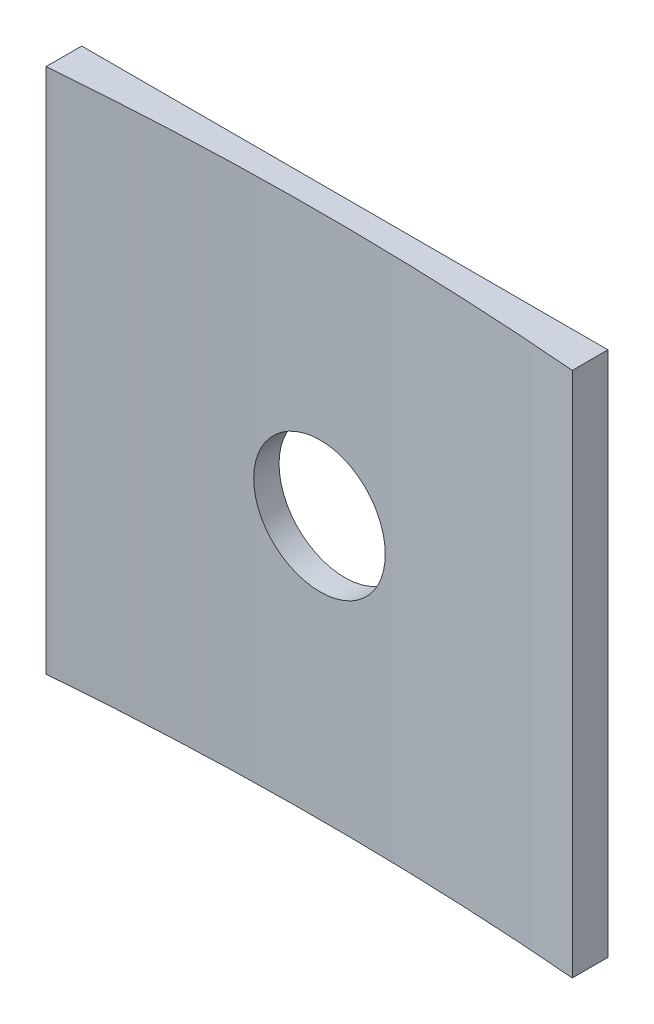
ISO-10303-21;
HEADER;
FILE_DESCRIPTION(('STEP AP214'),'2;1');
FILE_NAME('part.step','',(''),(''),'','','');
FILE_SCHEMA(('AUTOMOTIVE_DESIGN { 1 0 10303 214 1 1 1 1 }'));
ENDSEC;
DATA;
#1=APPLICATION_CONTEXT('core data for automotive mechanical design processes');
#2=APPLICATION_PROTOCOL_DEFINITION('international standard','automotive_design',2000,#1);
#3=PRODUCT_CONTEXT('',#1,'mechanical');
#4=PRODUCT('Part','Part','',(#3));
#5=PRODUCT_RELATED_PRODUCT_CATEGORY('part','',(#4));
#6=PRODUCT_DEFINITION_FORMATION('','',#4);
#7=PRODUCT_DEFINITION_CONTEXT('part definition',#1,'design');
#8=PRODUCT_DEFINITION('design','',#6,#7);
#9=PRODUCT_DEFINITION_SHAPE('','',#8);
#10=(LENGTH_UNIT() NAMED_UNIT(*) SI_UNIT(.MILLI.,.METRE.));
#11=(NAMED_UNIT(*) PLANE_ANGLE_UNIT() SI_UNIT($,.RADIAN.));
#12=(NAMED_UNIT(*) SI_UNIT($,.STERADIAN.) SOLID_ANGLE_UNIT());
#13=UNCERTAINTY_MEASURE_WITH_UNIT(LENGTH_MEASURE(1.E-05),#10,'distance_accuracy_value','');
#14=(GEOMETRIC_REPRESENTATION_CONTEXT(3) GLOBAL_UNCERTAINTY_ASSIGNED_CONTEXT((#13)) GLOBAL_UNIT_ASSIGNED_CONTEXT((#10,
#11,#12)) REPRESENTATION_CONTEXT('',''));
#15=CARTESIAN_POINT('',(0.,0.,0.));
#16=DIRECTION('',(0.,0.,1.));
#17=DIRECTION('',(1.,0.,0.));
#18=AXIS2_PLACEMENT_3D('',#15,#16,#17);
#19=CARTESIAN_POINT('',(0.,-25.4,0.));
#20=DIRECTION('',(0.,1.,0.));
#21=DIRECTION('',(0.,0.,1.));
#22=AXIS2_PLACEMENT_3D('',#19,#20,#21);
#23=CYLINDRICAL_SURFACE('',#22,152.4);
#24=CARTESIAN_POINT('',(-3.175,-12.7,-152.366923493913));
#25=CARTESIAN_POINT('',(-3.1749920986252,-12.8783203798337,-152.366923940762));
#26=CARTESIAN_POINT('',(-3.15992683175384,-13.0567695662421,-152.367239897938));
#27=CARTESIAN_POINT('',(-3.1000383491932,-13.4087519311199,-152.36846991657));
#28=CARTESIAN_POINT('',(-3.05517944647312,-13.5822789535593,-152.36938469528));
#29=CARTESIAN_POINT('',(-2.93698255450984,-13.9192668049938,-152.371708684941));
#30=CARTESIAN_POINT('',(-2.86365832693572,-14.0827324540227,-152.37311765694));
#31=CARTESIAN_POINT('',(-2.69063149875452,-14.3949882174427,-152.376270963536));
#32=CARTESIAN_POINT('',(-2.59093539949493,-14.5437819364496,-152.378015215448));
#33=CARTESIAN_POINT('',(-2.36795868767862,-14.8225601356859,-152.381643153922));
#34=CARTESIAN_POINT('',(-2.24467241532279,-14.9525400889091,-152.383526873878));
#35=CARTESIAN_POINT('',(-1.97802331457526,-15.1899635508147,-152.387221133212));
#36=CARTESIAN_POINT('',(-1.83465969279886,-15.2974061684833,-152.389031669694));
#37=CARTESIAN_POINT('',(-1.53191601878581,-15.486706384046,-152.392375519086));
#38=CARTESIAN_POINT('',(-1.372534809831,-15.5685621324144,-152.393908811953));
#39=CARTESIAN_POINT('',(-1.04228863671553,-15.7043526227995,-152.396525138538));
#40=CARTESIAN_POINT('',(-0.871423706708971,-15.7582874478525,-152.397608173595));
#41=CARTESIAN_POINT('',(-0.52308649704307,-15.836697725036,-152.399201752784));
#42=CARTESIAN_POINT('',(-0.345615180660369,-15.8611774548002,-152.399712380045));
#43=CARTESIAN_POINT('',(0.0109186159938498,-15.8799957970201,-152.400103857121));
#44=CARTESIAN_POINT('',(0.189981091717756,-15.8743344955927,-152.399984708736));
#45=CARTESIAN_POINT('',(0.54458524211617,-15.8330351861322,-152.399130139551));
#46=CARTESIAN_POINT('',(0.720127457995702,-15.7974018227461,-152.398394814236));
#47=CARTESIAN_POINT('',(1.06273772421929,-15.6971770586899,-152.396390888777));
#48=CARTESIAN_POINT('',(1.22980576093812,-15.6325856114612,-152.395122287775));
#49=CARTESIAN_POINT('',(1.5507399909113,-15.4762728840765,-152.392194648686));
#50=CARTESIAN_POINT('',(1.70460514634153,-15.3845494737043,-152.390535579945));
#51=CARTESIAN_POINT('',(1.99475447265447,-15.1765781559269,-152.387014017177));
#52=CARTESIAN_POINT('',(2.13103862784003,-15.0603302266253,-152.385151522969));
#53=CARTESIAN_POINT('',(2.38218444686974,-14.8065834146978,-152.381432632009));
#54=CARTESIAN_POINT('',(2.49704203268128,-14.6690804957832,-152.379576236485));
#55=CARTESIAN_POINT('',(2.70204289911422,-14.376741204736,-152.376079192425));
#56=CARTESIAN_POINT('',(2.79218617615158,-14.2219048300897,-152.37443854392));
#57=CARTESIAN_POINT('',(2.94519907076089,-13.8992916950645,-152.371558001611));
#58=CARTESIAN_POINT('',(3.0080685628991,-13.7315148751759,-152.370318109648));
#59=CARTESIAN_POINT('',(3.10474663395198,-13.3877845080458,-152.368378957879));
#60=CARTESIAN_POINT('',(3.13855525171725,-13.2118309717359,-152.36767969735));
#61=CARTESIAN_POINT('',(3.17614686990949,-12.8567773711966,-152.366900777384));
#62=CARTESIAN_POINT('',(3.17993551495527,-12.6776779048402,-152.366821001466));
#63=CARTESIAN_POINT('',(3.1573943437747,-12.3213853649273,-152.367289741507));
#64=CARTESIAN_POINT('',(3.13106454366545,-12.1441922903507,-152.36783825713));
#65=CARTESIAN_POINT('',(3.04903857048439,-11.796758190714,-152.369501636592));
#66=CARTESIAN_POINT('',(2.99334495657732,-11.6265165612028,-152.370616451077));
#67=CARTESIAN_POINT('',(2.85417491731163,-11.2977994273624,-152.373286705928));
#68=CARTESIAN_POINT('',(2.77069846682816,-11.1393239336739,-152.374842146693));
#69=CARTESIAN_POINT('',(2.57831781837455,-10.8386116628775,-152.378218584074));
#70=CARTESIAN_POINT('',(2.46940981749153,-10.6963773191347,-152.380039620391));
#71=CARTESIAN_POINT('',(2.22926317456083,-10.4322093183167,-152.383741810638));
#72=CARTESIAN_POINT('',(2.09802450037049,-10.3102756904627,-152.385622964656));
#73=CARTESIAN_POINT('',(1.8169177849111,-10.090151637434,-152.38923365395));
#74=CARTESIAN_POINT('',(1.66704689141537,-9.99196485422721,-152.390963165945));
#75=CARTESIAN_POINT('',(1.35294475663512,-9.82214663581258,-152.39407526353));
#76=CARTESIAN_POINT('',(1.18871353881953,-9.75051515720666,-152.395457849686));
#77=CARTESIAN_POINT('',(0.850566469601386,-9.63584725415542,-152.397720120313));
#78=CARTESIAN_POINT('',(0.676651422467755,-9.59280845883615,-152.398599846479));
#79=CARTESIAN_POINT('',(0.324061974118008,-9.53653984473758,-152.399757387774));
#80=CARTESIAN_POINT('',(0.145387570469758,-9.52331004119163,-152.400035202594));
#81=CARTESIAN_POINT('',(-0.211611865014944,-9.52703529544678,-152.399957603087));
#82=CARTESIAN_POINT('',(-0.389936957071266,-9.54398458755496,-152.399602309715));
#83=CARTESIAN_POINT('',(-0.741210124178171,-9.60757510460974,-152.398298776041));
#84=CARTESIAN_POINT('',(-0.914158188486152,-9.65421638887308,-152.397350534555));
#85=CARTESIAN_POINT('',(-1.24977155098012,-9.77586668685811,-152.394967951465));
#86=CARTESIAN_POINT('',(-1.4124366640485,-9.85087621110601,-152.393533601114));
#87=CARTESIAN_POINT('',(-1.7228600606918,-10.0271300866237,-152.390340503903));
#88=CARTESIAN_POINT('',(-1.87061890697541,-10.1283734470559,-152.388581769296));
#89=CARTESIAN_POINT('',(-2.14705798542837,-10.3542316746816,-152.384937868475));
#90=CARTESIAN_POINT('',(-2.27573660154825,-10.4788485195305,-152.38305269157));
#91=CARTESIAN_POINT('',(-2.51038012985537,-10.747952871158,-152.379368034243));
#92=CARTESIAN_POINT('',(-2.61633939894465,-10.8924453000967,-152.377568575197));
#93=CARTESIAN_POINT('',(-2.80254543733462,-11.197239434375,-152.374257813369));
#94=CARTESIAN_POINT('',(-2.88277778510863,-11.3575499411138,-152.372746672397));
#95=CARTESIAN_POINT('',(-3.0150965250472,-11.6892440011975,-152.370186106662));
#96=CARTESIAN_POINT('',(-3.06721657302619,-11.8606140375961,-152.369136130076));
#97=CARTESIAN_POINT('',(-3.12797806838276,-12.1442263371796,-152.367897733141));
#98=CARTESIAN_POINT('',(-3.14558919908283,-12.2546266886159,-152.367533973729));
#99=CARTESIAN_POINT('',(-3.16910263859059,-12.4766678491507,-152.367046714189));
#100=CARTESIAN_POINT('',(-3.17500494904259,-12.588308658075,-152.366923214029));
#101=CARTESIAN_POINT('',(-3.175,-12.7,-152.366923493913));
#102=B_SPLINE_CURVE_WITH_KNOTS('',3,(#24,#25,#26,#27,#28,#29,#30,#31,#32,#33,#34,#35,#36,#37,
#38,#39,#40,#41,#42,#43,#44,#45,#46,#47,#48,#49,#50,#51,#52,#53,#54,#55,#56,#57,#58,#59,#60,#61,
#62,#63,#64,#65,#66,#67,#68,#69,#70,#71,#72,#73,#74,#75,#76,#77,#78,#79,#80,#81,#82,#83,#84,#85,
#86,#87,#88,#89,#90,#91,#92,#93,#94,#95,#96,#97,#98,#99,#100,#101),.UNSPECIFIED.,.T.,.F.,(4,2,2,
2,2,2,2,2,2,2,2,2,2,2,2,2,2,2,2,2,2,2,2,2,2,2,2,2,2,2,2,2,2,2,2,2,2,2,4),(0.,0.534553459243709,
1.06974836800196,1.60468485633052,2.13948959170376,2.67442279969665,3.20937715229556,
3.74437016469157,4.27936158601811,4.81427530351562,5.3491874926945,5.8840168040057,
6.41884697521621,6.95371914878561,7.48859179991102,8.0235661475625,8.55854057279524,
9.09351745838061,9.62849362877031,10.1633692058565,10.6982444967182,11.2330731789282,
11.7679023448013,12.302811537752,12.8377215006549,13.3727134488225,13.9077045226743,
14.4426512301139,14.9775982109282,15.5124430015009,16.0472888605551,16.5821443453676,
17.1169796319278,17.6518601919033,18.1868734535705,18.7221861010044,19.2568564459882,
19.5916751674029,19.9264938417982),.UNSPECIFIED.);
#103=CARTESIAN_POINT('',(-3.175,-12.7,-152.366923493913));
#104=VERTEX_POINT('',#103);
#105=EDGE_CURVE('E104',#104,#104,#102,.T.);
#106=ORIENTED_EDGE('',*,*,#105,.F.);
#107=EDGE_LOOP('',(#106));
#108=FACE_BOUND('',#107,.T.);
#109=CARTESIAN_POINT('',(0.,0.,0.));
#110=DIRECTION('',(0.,-1.,0.));
#111=DIRECTION('',(0.,0.,1.));
#112=AXIS2_PLACEMENT_3D('',#109,#110,#111);
#113=CIRCLE('',#112,152.4);
#114=CARTESIAN_POINT('',(-12.7,0.,-151.869911437388));
#115=VERTEX_POINT('',#114);
#116=CARTESIAN_POINT('',(12.7,0.,-151.869911437388));
#117=VERTEX_POINT('',#116);
#118=EDGE_CURVE('E97',#115,#117,#113,.T.);
#119=ORIENTED_EDGE('',*,*,#118,.F.);
#120=DIRECTION('',(0.,1.,0.));
#121=VECTOR('',#120,1.);
#122=CARTESIAN_POINT('',(-12.7,-25.4,-151.869911437388));
#123=LINE('',#122,#121);
#124=CARTESIAN_POINT('',(-12.7,-25.4,-151.869911437388));
#125=VERTEX_POINT('',#124);
#126=EDGE_CURVE('E11',#125,#115,#123,.T.);
#127=ORIENTED_EDGE('',*,*,#126,.F.);
#128=CARTESIAN_POINT('',(0.,-25.4,0.));
#129=DIRECTION('',(0.,-1.,0.));
#130=DIRECTION('',(0.,0.,-1.));
#131=AXIS2_PLACEMENT_3D('',#128,#129,#130);
#132=CIRCLE('',#131,152.4);
#133=CARTESIAN_POINT('',(12.7,-25.4,-151.869911437388));
#134=VERTEX_POINT('',#133);
#135=EDGE_CURVE('E56',#125,#134,#132,.T.);
#136=ORIENTED_EDGE('',*,*,#135,.T.);
#137=DIRECTION('',(0.,1.,0.));
#138=VECTOR('',#137,1.);
#139=CARTESIAN_POINT('',(12.7,-25.4,-151.869911437388));
#140=LINE('',#139,#138);
#141=EDGE_CURVE('E41',#134,#117,#140,.T.);
#142=ORIENTED_EDGE('',*,*,#141,.T.);
#143=EDGE_LOOP('',(#119,#127,#136,#142));
#144=FACE_BOUND('',#143,.T.);
#145=ADVANCED_FACE('F37',(#108,#144),#23,.F.);
#146=CARTESIAN_POINT('',(-12.7,-25.4,-151.869911437388));
#147=DIRECTION('',(-1.,0.,0.));
#148=DIRECTION('',(0.,0.,1.));
#149=AXIS2_PLACEMENT_3D('',#146,#147,#148);
#150=PLANE('',#149);
#151=DIRECTION('',(0.,0.,1.));
#152=VECTOR('',#151,1.);
#153=CARTESIAN_POINT('',(-12.7,0.,-151.869911437388));
#154=LINE('',#153,#152);
#155=CARTESIAN_POINT('',(-12.7,0.,-153.590837637388));
#156=VERTEX_POINT('',#155);
#157=EDGE_CURVE('E106',#156,#115,#154,.T.);
#158=ORIENTED_EDGE('',*,*,#157,.F.);
#159=DIRECTION('',(0.,1.,0.));
#160=VECTOR('',#159,1.);
#161=CARTESIAN_POINT('',(-12.7,-25.4,-153.590837637388));
#162=LINE('',#161,#160);
#163=CARTESIAN_POINT('',(-12.7,-25.4,-153.590837637388));
#164=VERTEX_POINT('',#163);
#165=EDGE_CURVE('E47',#164,#156,#162,.T.);
#166=ORIENTED_EDGE('',*,*,#165,.F.);
#167=DIRECTION('',(0.,0.,1.));
#168=VECTOR('',#167,1.);
#169=CARTESIAN_POINT('',(-12.7,-25.4,-151.869911437388));
#170=LINE('',#169,#168);
#171=EDGE_CURVE('E94',#164,#125,#170,.T.);
#172=ORIENTED_EDGE('',*,*,#171,.T.);
#173=ORIENTED_EDGE('',*,*,#126,.T.);
#174=EDGE_LOOP('',(#158,#166,#172,#173));
#175=FACE_BOUND('',#174,.T.);
#176=ADVANCED_FACE('F113',(#175),#150,.T.);
#177=CARTESIAN_POINT('',(-12.7,-25.4,-153.590837637388));
#178=DIRECTION('',(0.,0.,-1.));
#179=DIRECTION('',(-1.,0.,0.));
#180=AXIS2_PLACEMENT_3D('',#177,#178,#179);
#181=PLANE('',#180);
#182=CARTESIAN_POINT('',(0.,-12.7,-153.590837637388));
#183=DIRECTION('',(0.,0.,-1.));
#184=DIRECTION('',(-1.,0.,0.));
#185=AXIS2_PLACEMENT_3D('',#182,#183,#184);
#186=CIRCLE('',#185,3.175);
#187=CARTESIAN_POINT('',(-3.175,-12.7,-153.590837637388));
#188=VERTEX_POINT('',#187);
#189=EDGE_CURVE('E132',#188,#188,#186,.T.);
#190=ORIENTED_EDGE('',*,*,#189,.F.);
#191=EDGE_LOOP('',(#190));
#192=FACE_BOUND('',#191,.T.);
#193=DIRECTION('',(-1.,0.,0.));
#194=VECTOR('',#193,1.);
#195=CARTESIAN_POINT('',(-12.7,0.,-153.590837637388));
#196=LINE('',#195,#194);
#197=CARTESIAN_POINT('',(12.7,0.,-153.590837637388));
#198=VERTEX_POINT('',#197);
#199=EDGE_CURVE('E90',#198,#156,#196,.T.);
#200=ORIENTED_EDGE('',*,*,#199,.F.);
#201=DIRECTION('',(0.,1.,0.));
#202=VECTOR('',#201,1.);
#203=CARTESIAN_POINT('',(12.7,-25.4,-153.590837637388));
#204=LINE('',#203,#202);
#205=CARTESIAN_POINT('',(12.7,-25.4,-153.590837637388));
#206=VERTEX_POINT('',#205);
#207=EDGE_CURVE('E85',#206,#198,#204,.T.);
#208=ORIENTED_EDGE('',*,*,#207,.F.);
#209=DIRECTION('',(-1.,0.,0.));
#210=VECTOR('',#209,1.);
#211=CARTESIAN_POINT('',(-12.7,-25.4,-153.590837637388));
#212=LINE('',#211,#210);
#213=EDGE_CURVE('E88',#206,#164,#212,.T.);
#214=ORIENTED_EDGE('',*,*,#213,.T.);
#215=ORIENTED_EDGE('',*,*,#165,.T.);
#216=EDGE_LOOP('',(#200,#208,#214,#215));
#217=FACE_BOUND('',#216,.T.);
#218=ADVANCED_FACE('F87',(#192,#217),#181,.T.);
#219=CARTESIAN_POINT('',(12.7,-25.4,-153.590837637388));
#220=DIRECTION('',(1.,0.,0.));
#221=DIRECTION('',(0.,0.,-1.));
#222=AXIS2_PLACEMENT_3D('',#219,#220,#221);
#223=PLANE('',#222);
#224=DIRECTION('',(0.,0.,-1.));
#225=VECTOR('',#224,1.);
#226=CARTESIAN_POINT('',(12.7,0.,-153.590837637388));
#227=LINE('',#226,#225);
#228=EDGE_CURVE('E102',#117,#198,#227,.T.);
#229=ORIENTED_EDGE('',*,*,#228,.F.);
#230=ORIENTED_EDGE('',*,*,#141,.F.);
#231=DIRECTION('',(0.,0.,-1.));
#232=VECTOR('',#231,1.);
#233=CARTESIAN_POINT('',(12.7,-25.4,-153.590837637388));
#234=LINE('',#233,#232);
#235=EDGE_CURVE('E93',#134,#206,#234,.T.);
#236=ORIENTED_EDGE('',*,*,#235,.T.);
#237=ORIENTED_EDGE('',*,*,#207,.T.);
#238=EDGE_LOOP('',(#229,#230,#236,#237));
#239=FACE_BOUND('',#238,.T.);
#240=ADVANCED_FACE('F39',(#239),#223,.T.);
#241=CARTESIAN_POINT('',(0.,-25.4,0.));
#242=DIRECTION('',(0.,-1.,0.));
#243=DIRECTION('',(0.,0.,-1.));
#244=AXIS2_PLACEMENT_3D('',#241,#242,#243);
#245=PLANE('',#244);
#246=ORIENTED_EDGE('',*,*,#135,.F.);
#247=ORIENTED_EDGE('',*,*,#171,.F.);
#248=ORIENTED_EDGE('',*,*,#213,.F.);
#249=ORIENTED_EDGE('',*,*,#235,.F.);
#250=EDGE_LOOP('',(#246,#247,#248,#249));
#251=FACE_BOUND('',#250,.T.);
#252=ADVANCED_FACE('F92',(#251),#245,.T.);
#253=CARTESIAN_POINT('',(0.,0.,0.));
#254=DIRECTION('',(0.,-1.,0.));
#255=DIRECTION('',(0.,0.,-1.));
#256=AXIS2_PLACEMENT_3D('',#253,#254,#255);
#257=PLANE('',#256);
#258=ORIENTED_EDGE('',*,*,#118,.T.);
#259=ORIENTED_EDGE('',*,*,#228,.T.);
#260=ORIENTED_EDGE('',*,*,#199,.T.);
#261=ORIENTED_EDGE('',*,*,#157,.T.);
#262=EDGE_LOOP('',(#258,#259,#260,#261));
#263=FACE_BOUND('',#262,.T.);
#264=ADVANCED_FACE('F111',(#263),#257,.F.);
#265=CARTESIAN_POINT('',(0.,-12.7,-151.869911437388));
#266=DIRECTION('',(0.,0.,-1.));
#267=DIRECTION('',(-1.,0.,0.));
#268=AXIS2_PLACEMENT_3D('',#265,#266,#267);
#269=CYLINDRICAL_SURFACE('',#268,3.175);
#270=ORIENTED_EDGE('',*,*,#105,.T.);
#271=EDGE_LOOP('',(#270));
#272=FACE_BOUND('',#271,.T.);
#273=ORIENTED_EDGE('',*,*,#189,.T.);
#274=EDGE_LOOP('',(#273));
#275=FACE_BOUND('',#274,.T.);
#276=ADVANCED_FACE('F133',(#272,#275),#269,.F.);
#277=CLOSED_SHELL('',(#145,#176,#218,#240,#252,#264,#276));
#278=MANIFOLD_SOLID_BREP('B2',#277);
#279=ADVANCED_BREP_SHAPE_REPRESENTATION('',(#18,#278),#14);
#280=SHAPE_DEFINITION_REPRESENTATION(#9,#279);
ENDSEC;
END-ISO-10303-21;
